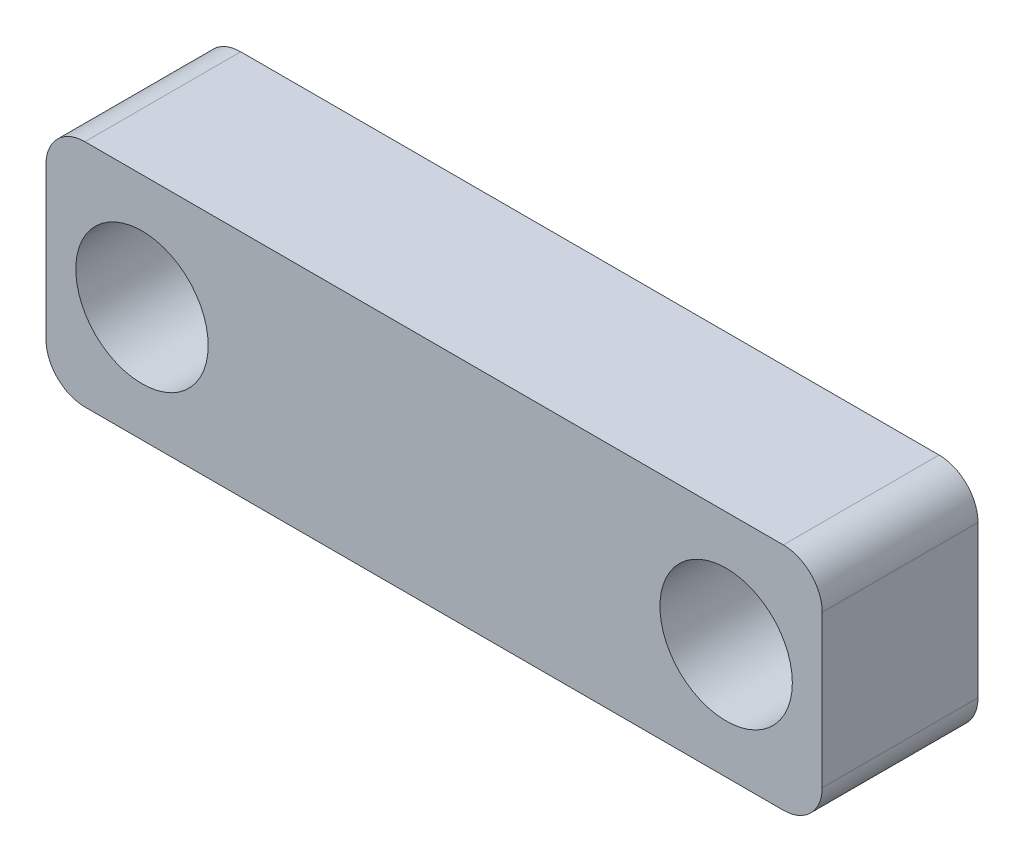
ISO-10303-21;
HEADER;
FILE_DESCRIPTION(('STEP AP214'),'2;1');
FILE_NAME('part.step','',(''),(''),'','','');
FILE_SCHEMA(('AUTOMOTIVE_DESIGN { 1 0 10303 214 1 1 1 1 }'));
ENDSEC;
DATA;
#1=APPLICATION_CONTEXT('core data for automotive mechanical design processes');
#2=APPLICATION_PROTOCOL_DEFINITION('international standard','automotive_design',2000,#1);
#3=PRODUCT_CONTEXT('',#1,'mechanical');
#4=PRODUCT('Part','Part','',(#3));
#5=PRODUCT_RELATED_PRODUCT_CATEGORY('part','',(#4));
#6=PRODUCT_DEFINITION_FORMATION('','',#4);
#7=PRODUCT_DEFINITION_CONTEXT('part definition',#1,'design');
#8=PRODUCT_DEFINITION('design','',#6,#7);
#9=PRODUCT_DEFINITION_SHAPE('','',#8);
#10=(LENGTH_UNIT() NAMED_UNIT(*) SI_UNIT(.MILLI.,.METRE.));
#11=(NAMED_UNIT(*) PLANE_ANGLE_UNIT() SI_UNIT($,.RADIAN.));
#12=(NAMED_UNIT(*) SI_UNIT($,.STERADIAN.) SOLID_ANGLE_UNIT());
#13=UNCERTAINTY_MEASURE_WITH_UNIT(LENGTH_MEASURE(1.E-05),#10,'distance_accuracy_value','');
#14=(GEOMETRIC_REPRESENTATION_CONTEXT(3) GLOBAL_UNCERTAINTY_ASSIGNED_CONTEXT((#13)) GLOBAL_UNIT_ASSIGNED_CONTEXT((#10,
#11,#12)) REPRESENTATION_CONTEXT('',''));
#15=CARTESIAN_POINT('',(0.,0.,0.));
#16=DIRECTION('',(0.,0.,1.));
#17=DIRECTION('',(1.,0.,0.));
#18=AXIS2_PLACEMENT_3D('',#15,#16,#17);
#19=CARTESIAN_POINT('',(-31.2221207225802,40.9398112558445,137.365661293432));
#20=DIRECTION('',(1.,0.,0.));
#21=DIRECTION('',(0.,0.,-1.));
#22=AXIS2_PLACEMENT_3D('',#19,#20,#21);
#23=PLANE('',#22);
#24=DIRECTION('',(0.,-1.,0.));
#25=VECTOR('',#24,1.);
#26=CARTESIAN_POINT('',(-31.2221207225802,40.9398112558445,133.365661293432));
#27=LINE('',#26,#25);
#28=CARTESIAN_POINT('',(-31.2221207225802,39.9398112558445,133.365661293432));
#29=VERTEX_POINT('',#28);
#30=CARTESIAN_POINT('',(-31.2221207225802,36.0398112558445,133.365661293432));
#31=VERTEX_POINT('',#30);
#32=EDGE_CURVE('E133',#29,#31,#27,.T.);
#33=ORIENTED_EDGE('',*,*,#32,.T.);
#34=DIRECTION('',(0.,0.,-1.));
#35=VECTOR('',#34,1.);
#36=CARTESIAN_POINT('',(-31.2221207225802,36.0398112558445,137.365661293432));
#37=LINE('',#36,#35);
#38=CARTESIAN_POINT('',(-31.2221207225802,36.0398112558445,137.365661293432));
#39=VERTEX_POINT('',#38);
#40=EDGE_CURVE('E11',#31,#39,#37,.F.);
#41=ORIENTED_EDGE('',*,*,#40,.T.);
#42=DIRECTION('',(0.,-1.,0.));
#43=VECTOR('',#42,1.);
#44=CARTESIAN_POINT('',(-31.2221207225802,40.9398112558445,137.365661293432));
#45=LINE('',#44,#43);
#46=CARTESIAN_POINT('',(-31.2221207225802,39.9398112558445,137.365661293432));
#47=VERTEX_POINT('',#46);
#48=EDGE_CURVE('E131',#47,#39,#45,.T.);
#49=ORIENTED_EDGE('',*,*,#48,.F.);
#50=DIRECTION('',(0.,0.,-1.));
#51=VECTOR('',#50,1.);
#52=CARTESIAN_POINT('',(-31.2221207225802,39.9398112558445,137.365661293432));
#53=LINE('',#52,#51);
#54=EDGE_CURVE('E44',#47,#29,#53,.T.);
#55=ORIENTED_EDGE('',*,*,#54,.T.);
#56=EDGE_LOOP('',(#33,#41,#49,#55));
#57=FACE_BOUND('',#56,.T.);
#58=ADVANCED_FACE('F35',(#57),#23,.F.);
#59=CARTESIAN_POINT('',(-31.2221207225802,35.0398112558445,137.365661293432));
#60=DIRECTION('',(0.,1.,0.));
#61=DIRECTION('',(0.,0.,1.));
#62=AXIS2_PLACEMENT_3D('',#59,#60,#61);
#63=PLANE('',#62);
#64=DIRECTION('',(1.,0.,0.));
#65=VECTOR('',#64,1.);
#66=CARTESIAN_POINT('',(-31.2221207225802,35.0398112558445,133.365661293432));
#67=LINE('',#66,#65);
#68=CARTESIAN_POINT('',(-30.2221207225802,35.0398112558445,133.365661293432));
#69=VERTEX_POINT('',#68);
#70=CARTESIAN_POINT('',(-12.2894893378649,35.0398112558445,133.365661293432));
#71=VERTEX_POINT('',#70);
#72=EDGE_CURVE('E129',#69,#71,#67,.T.);
#73=ORIENTED_EDGE('',*,*,#72,.T.);
#74=DIRECTION('',(0.,0.,-1.));
#75=VECTOR('',#74,1.);
#76=CARTESIAN_POINT('',(-12.2894893378649,35.0398112558445,137.365661293432));
#77=LINE('',#76,#75);
#78=CARTESIAN_POINT('',(-12.2894893378649,35.0398112558445,137.365661293432));
#79=VERTEX_POINT('',#78);
#80=EDGE_CURVE('E108',#71,#79,#77,.F.);
#81=ORIENTED_EDGE('',*,*,#80,.T.);
#82=DIRECTION('',(1.,0.,0.));
#83=VECTOR('',#82,1.);
#84=CARTESIAN_POINT('',(-31.2221207225802,35.0398112558445,137.365661293432));
#85=LINE('',#84,#83);
#86=CARTESIAN_POINT('',(-30.2221207225802,35.0398112558445,137.365661293432));
#87=VERTEX_POINT('',#86);
#88=EDGE_CURVE('E174',#87,#79,#85,.T.);
#89=ORIENTED_EDGE('',*,*,#88,.F.);
#90=DIRECTION('',(0.,0.,-1.));
#91=VECTOR('',#90,1.);
#92=CARTESIAN_POINT('',(-30.2221207225802,35.0398112558445,137.365661293432));
#93=LINE('',#92,#91);
#94=EDGE_CURVE('E113',#87,#69,#93,.T.);
#95=ORIENTED_EDGE('',*,*,#94,.T.);
#96=EDGE_LOOP('',(#73,#81,#89,#95));
#97=FACE_BOUND('',#96,.T.);
#98=ADVANCED_FACE('F193',(#97),#63,.F.);
#99=CARTESIAN_POINT('',(-11.2894893378649,40.9398112558445,137.365661293432));
#100=DIRECTION('',(-1.,0.,0.));
#101=DIRECTION('',(0.,-1.,0.));
#102=AXIS2_PLACEMENT_3D('',#99,#100,#101);
#103=PLANE('',#102);
#104=DIRECTION('',(0.,1.,0.));
#105=VECTOR('',#104,1.);
#106=CARTESIAN_POINT('',(-11.2894893378649,40.9398112558445,137.365661293432));
#107=LINE('',#106,#105);
#108=CARTESIAN_POINT('',(-11.2894893378649,36.0398112558445,137.365661293432));
#109=VERTEX_POINT('',#108);
#110=CARTESIAN_POINT('',(-11.2894893378649,39.9398112558445,137.365661293432));
#111=VERTEX_POINT('',#110);
#112=EDGE_CURVE('E122',#109,#111,#107,.T.);
#113=ORIENTED_EDGE('',*,*,#112,.F.);
#114=DIRECTION('',(0.,0.,-1.));
#115=VECTOR('',#114,1.);
#116=CARTESIAN_POINT('',(-11.2894893378649,36.0398112558445,137.365661293432));
#117=LINE('',#116,#115);
#118=CARTESIAN_POINT('',(-11.2894893378649,36.0398112558445,133.365661293432));
#119=VERTEX_POINT('',#118);
#120=EDGE_CURVE('E107',#109,#119,#117,.T.);
#121=ORIENTED_EDGE('',*,*,#120,.T.);
#122=DIRECTION('',(0.,1.,0.));
#123=VECTOR('',#122,1.);
#124=CARTESIAN_POINT('',(-11.2894893378649,40.9398112558445,133.365661293432));
#125=LINE('',#124,#123);
#126=CARTESIAN_POINT('',(-11.2894893378649,39.9398112558445,133.365661293432));
#127=VERTEX_POINT('',#126);
#128=EDGE_CURVE('E120',#119,#127,#125,.T.);
#129=ORIENTED_EDGE('',*,*,#128,.T.);
#130=DIRECTION('',(0.,0.,-1.));
#131=VECTOR('',#130,1.);
#132=CARTESIAN_POINT('',(-11.2894893378649,39.9398112558445,137.365661293432));
#133=LINE('',#132,#131);
#134=EDGE_CURVE('E124',#127,#111,#133,.F.);
#135=ORIENTED_EDGE('',*,*,#134,.T.);
#136=EDGE_LOOP('',(#113,#121,#129,#135));
#137=FACE_BOUND('',#136,.T.);
#138=ADVANCED_FACE('F119',(#137),#103,.F.);
#139=CARTESIAN_POINT('',(-31.2221207225802,40.9398112558445,137.365661293432));
#140=DIRECTION('',(0.,-1.,0.));
#141=DIRECTION('',(0.,0.,-1.));
#142=AXIS2_PLACEMENT_3D('',#139,#140,#141);
#143=PLANE('',#142);
#144=DIRECTION('',(-1.,0.,0.));
#145=VECTOR('',#144,1.);
#146=CARTESIAN_POINT('',(-31.2221207225802,40.9398112558445,137.365661293432));
#147=LINE('',#146,#145);
#148=CARTESIAN_POINT('',(-12.2894893378649,40.9398112558445,137.365661293432));
#149=VERTEX_POINT('',#148);
#150=CARTESIAN_POINT('',(-30.2221207225802,40.9398112558445,137.365661293432));
#151=VERTEX_POINT('',#150);
#152=EDGE_CURVE('E137',#149,#151,#147,.T.);
#153=ORIENTED_EDGE('',*,*,#152,.F.);
#154=DIRECTION('',(0.,0.,-1.));
#155=VECTOR('',#154,1.);
#156=CARTESIAN_POINT('',(-12.2894893378649,40.9398112558445,137.365661293432));
#157=LINE('',#156,#155);
#158=CARTESIAN_POINT('',(-12.2894893378649,40.9398112558445,133.365661293432));
#159=VERTEX_POINT('',#158);
#160=EDGE_CURVE('E154',#149,#159,#157,.T.);
#161=ORIENTED_EDGE('',*,*,#160,.T.);
#162=DIRECTION('',(-1.,0.,0.));
#163=VECTOR('',#162,1.);
#164=CARTESIAN_POINT('',(-31.2221207225802,40.9398112558445,133.365661293432));
#165=LINE('',#164,#163);
#166=CARTESIAN_POINT('',(-30.2221207225802,40.9398112558445,133.365661293432));
#167=VERTEX_POINT('',#166);
#168=EDGE_CURVE('E128',#159,#167,#165,.T.);
#169=ORIENTED_EDGE('',*,*,#168,.T.);
#170=DIRECTION('',(0.,0.,-1.));
#171=VECTOR('',#170,1.);
#172=CARTESIAN_POINT('',(-30.2221207225802,40.9398112558445,137.365661293432));
#173=LINE('',#172,#171);
#174=EDGE_CURVE('E52',#167,#151,#173,.F.);
#175=ORIENTED_EDGE('',*,*,#174,.T.);
#176=EDGE_LOOP('',(#153,#161,#169,#175));
#177=FACE_BOUND('',#176,.T.);
#178=ADVANCED_FACE('F196',(#177),#143,.F.);
#179=CARTESIAN_POINT('',(0.,0.,137.365661293432));
#180=DIRECTION('',(0.,0.,1.));
#181=DIRECTION('',(1.,0.,0.));
#182=AXIS2_PLACEMENT_3D('',#179,#180,#181);
#183=PLANE('',#182);
#184=CARTESIAN_POINT('',(-28.7571207225802,37.9898112558445,137.365661293432));
#185=DIRECTION('',(0.,0.,1.));
#186=DIRECTION('',(1.,0.,0.));
#187=AXIS2_PLACEMENT_3D('',#184,#185,#186);
#188=CIRCLE('',#187,1.7);
#189=CARTESIAN_POINT('',(-27.0571207225802,37.9898112558445,137.365661293432));
#190=VERTEX_POINT('',#189);
#191=EDGE_CURVE('E169',#190,#190,#188,.T.);
#192=ORIENTED_EDGE('',*,*,#191,.F.);
#193=EDGE_LOOP('',(#192));
#194=FACE_BOUND('',#193,.T.);
#195=CARTESIAN_POINT('',(-13.7571207225802,37.9898112558445,137.365661293432));
#196=DIRECTION('',(0.,0.,1.));
#197=DIRECTION('',(1.,0.,0.));
#198=AXIS2_PLACEMENT_3D('',#195,#196,#197);
#199=CIRCLE('',#198,1.7);
#200=CARTESIAN_POINT('',(-12.0571207225802,37.9898112558445,137.365661293432));
#201=VERTEX_POINT('',#200);
#202=EDGE_CURVE('E160',#201,#201,#199,.T.);
#203=ORIENTED_EDGE('',*,*,#202,.F.);
#204=EDGE_LOOP('',(#203));
#205=FACE_BOUND('',#204,.T.);
#206=ORIENTED_EDGE('',*,*,#88,.T.);
#207=CARTESIAN_POINT('',(-12.2894893378649,36.0398112558445,137.365661293432));
#208=DIRECTION('',(0.,0.,1.));
#209=DIRECTION('',(1.,0.,0.));
#210=AXIS2_PLACEMENT_3D('',#207,#208,#209);
#211=CIRCLE('',#210,1.);
#212=EDGE_CURVE('E151',#79,#109,#211,.T.);
#213=ORIENTED_EDGE('',*,*,#212,.T.);
#214=ORIENTED_EDGE('',*,*,#112,.T.);
#215=CARTESIAN_POINT('',(-12.2894893378649,39.9398112558445,137.365661293432));
#216=DIRECTION('',(0.,0.,1.));
#217=DIRECTION('',(1.,0.,0.));
#218=AXIS2_PLACEMENT_3D('',#215,#216,#217);
#219=CIRCLE('',#218,1.);
#220=EDGE_CURVE('E59',#111,#149,#219,.T.);
#221=ORIENTED_EDGE('',*,*,#220,.T.);
#222=ORIENTED_EDGE('',*,*,#152,.T.);
#223=CARTESIAN_POINT('',(-30.2221207225802,39.9398112558445,137.365661293432));
#224=DIRECTION('',(0.,0.,1.));
#225=DIRECTION('',(1.,0.,0.));
#226=AXIS2_PLACEMENT_3D('',#223,#224,#225);
#227=CIRCLE('',#226,1.);
#228=EDGE_CURVE('E146',#151,#47,#227,.T.);
#229=ORIENTED_EDGE('',*,*,#228,.T.);
#230=ORIENTED_EDGE('',*,*,#48,.T.);
#231=CARTESIAN_POINT('',(-30.2221207225802,36.0398112558445,137.365661293432));
#232=DIRECTION('',(0.,0.,1.));
#233=DIRECTION('',(1.,0.,0.));
#234=AXIS2_PLACEMENT_3D('',#231,#232,#233);
#235=CIRCLE('',#234,1.);
#236=EDGE_CURVE('E148',#39,#87,#235,.T.);
#237=ORIENTED_EDGE('',*,*,#236,.T.);
#238=EDGE_LOOP('',(#206,#213,#214,#221,#222,#229,#230,#237));
#239=FACE_BOUND('',#238,.T.);
#240=ADVANCED_FACE('F179',(#194,#205,#239),#183,.T.);
#241=CARTESIAN_POINT('',(0.,0.,133.365661293432));
#242=DIRECTION('',(0.,0.,1.));
#243=DIRECTION('',(1.,0.,0.));
#244=AXIS2_PLACEMENT_3D('',#241,#242,#243);
#245=PLANE('',#244);
#246=CARTESIAN_POINT('',(-28.7571207225802,37.9898112558445,133.365661293432));
#247=DIRECTION('',(0.,0.,1.));
#248=DIRECTION('',(1.,0.,0.));
#249=AXIS2_PLACEMENT_3D('',#246,#247,#248);
#250=CIRCLE('',#249,1.7);
#251=CARTESIAN_POINT('',(-27.0571207225802,37.9898112558445,133.365661293432));
#252=VERTEX_POINT('',#251);
#253=EDGE_CURVE('E39',#252,#252,#250,.T.);
#254=ORIENTED_EDGE('',*,*,#253,.T.);
#255=EDGE_LOOP('',(#254));
#256=FACE_BOUND('',#255,.T.);
#257=CARTESIAN_POINT('',(-13.7571207225802,37.9898112558445,133.365661293432));
#258=DIRECTION('',(0.,0.,1.));
#259=DIRECTION('',(1.,0.,0.));
#260=AXIS2_PLACEMENT_3D('',#257,#258,#259);
#261=CIRCLE('',#260,1.7);
#262=CARTESIAN_POINT('',(-12.0571207225802,37.9898112558445,133.365661293432));
#263=VERTEX_POINT('',#262);
#264=EDGE_CURVE('E158',#263,#263,#261,.T.);
#265=ORIENTED_EDGE('',*,*,#264,.T.);
#266=EDGE_LOOP('',(#265));
#267=FACE_BOUND('',#266,.T.);
#268=ORIENTED_EDGE('',*,*,#128,.F.);
#269=CARTESIAN_POINT('',(-12.2894893378649,36.0398112558445,133.365661293432));
#270=DIRECTION('',(0.,0.,1.));
#271=DIRECTION('',(1.,0.,0.));
#272=AXIS2_PLACEMENT_3D('',#269,#270,#271);
#273=CIRCLE('',#272,1.);
#274=EDGE_CURVE('E103',#119,#71,#273,.F.);
#275=ORIENTED_EDGE('',*,*,#274,.T.);
#276=ORIENTED_EDGE('',*,*,#72,.F.);
#277=CARTESIAN_POINT('',(-30.2221207225802,36.0398112558445,133.365661293432));
#278=DIRECTION('',(0.,0.,1.));
#279=DIRECTION('',(1.,0.,0.));
#280=AXIS2_PLACEMENT_3D('',#277,#278,#279);
#281=CIRCLE('',#280,1.);
#282=EDGE_CURVE('E140',#69,#31,#281,.F.);
#283=ORIENTED_EDGE('',*,*,#282,.T.);
#284=ORIENTED_EDGE('',*,*,#32,.F.);
#285=CARTESIAN_POINT('',(-30.2221207225802,39.9398112558445,133.365661293432));
#286=DIRECTION('',(0.,0.,1.));
#287=DIRECTION('',(1.,0.,0.));
#288=AXIS2_PLACEMENT_3D('',#285,#286,#287);
#289=CIRCLE('',#288,1.);
#290=EDGE_CURVE('E123',#29,#167,#289,.F.);
#291=ORIENTED_EDGE('',*,*,#290,.T.);
#292=ORIENTED_EDGE('',*,*,#168,.F.);
#293=CARTESIAN_POINT('',(-12.2894893378649,39.9398112558445,133.365661293432));
#294=DIRECTION('',(0.,0.,1.));
#295=DIRECTION('',(1.,0.,0.));
#296=AXIS2_PLACEMENT_3D('',#293,#294,#295);
#297=CIRCLE('',#296,1.);
#298=EDGE_CURVE('E114',#159,#127,#297,.F.);
#299=ORIENTED_EDGE('',*,*,#298,.T.);
#300=EDGE_LOOP('',(#268,#275,#276,#283,#284,#291,#292,#299));
#301=FACE_BOUND('',#300,.T.);
#302=ADVANCED_FACE('F126',(#256,#267,#301),#245,.F.);
#303=CARTESIAN_POINT('',(-12.2894893378649,36.0398112558445,137.365661293432));
#304=DIRECTION('',(0.,0.,-1.));
#305=DIRECTION('',(-1.,0.,0.));
#306=AXIS2_PLACEMENT_3D('',#303,#304,#305);
#307=CYLINDRICAL_SURFACE('',#306,1.);
#308=ORIENTED_EDGE('',*,*,#212,.F.);
#309=ORIENTED_EDGE('',*,*,#80,.F.);
#310=ORIENTED_EDGE('',*,*,#274,.F.);
#311=ORIENTED_EDGE('',*,*,#120,.F.);
#312=EDGE_LOOP('',(#308,#309,#310,#311));
#313=FACE_BOUND('',#312,.T.);
#314=ADVANCED_FACE('F106',(#313),#307,.T.);
#315=CARTESIAN_POINT('',(-12.2894893378649,39.9398112558445,137.365661293432));
#316=DIRECTION('',(0.,0.,-1.));
#317=DIRECTION('',(-1.,0.,0.));
#318=AXIS2_PLACEMENT_3D('',#315,#316,#317);
#319=CYLINDRICAL_SURFACE('',#318,1.);
#320=ORIENTED_EDGE('',*,*,#220,.F.);
#321=ORIENTED_EDGE('',*,*,#134,.F.);
#322=ORIENTED_EDGE('',*,*,#298,.F.);
#323=ORIENTED_EDGE('',*,*,#160,.F.);
#324=EDGE_LOOP('',(#320,#321,#322,#323));
#325=FACE_BOUND('',#324,.T.);
#326=ADVANCED_FACE('F195',(#325),#319,.T.);
#327=CARTESIAN_POINT('',(-30.2221207225802,36.0398112558445,137.365661293432));
#328=DIRECTION('',(0.,0.,-1.));
#329=DIRECTION('',(-1.,0.,0.));
#330=AXIS2_PLACEMENT_3D('',#327,#328,#329);
#331=CYLINDRICAL_SURFACE('',#330,1.);
#332=ORIENTED_EDGE('',*,*,#236,.F.);
#333=ORIENTED_EDGE('',*,*,#40,.F.);
#334=ORIENTED_EDGE('',*,*,#282,.F.);
#335=ORIENTED_EDGE('',*,*,#94,.F.);
#336=EDGE_LOOP('',(#332,#333,#334,#335));
#337=FACE_BOUND('',#336,.T.);
#338=ADVANCED_FACE('F190',(#337),#331,.T.);
#339=CARTESIAN_POINT('',(-30.2221207225802,39.9398112558445,137.365661293432));
#340=DIRECTION('',(0.,0.,-1.));
#341=DIRECTION('',(-1.,0.,0.));
#342=AXIS2_PLACEMENT_3D('',#339,#340,#341);
#343=CYLINDRICAL_SURFACE('',#342,1.);
#344=ORIENTED_EDGE('',*,*,#228,.F.);
#345=ORIENTED_EDGE('',*,*,#174,.F.);
#346=ORIENTED_EDGE('',*,*,#290,.F.);
#347=ORIENTED_EDGE('',*,*,#54,.F.);
#348=EDGE_LOOP('',(#344,#345,#346,#347));
#349=FACE_BOUND('',#348,.T.);
#350=ADVANCED_FACE('F37',(#349),#343,.T.);
#351=CARTESIAN_POINT('',(-13.7571207225802,37.9898112558445,137.365661293432));
#352=DIRECTION('',(0.,0.,1.));
#353=DIRECTION('',(1.,0.,0.));
#354=AXIS2_PLACEMENT_3D('',#351,#352,#353);
#355=CYLINDRICAL_SURFACE('',#354,1.7);
#356=ORIENTED_EDGE('',*,*,#202,.T.);
#357=EDGE_LOOP('',(#356));
#358=FACE_BOUND('',#357,.T.);
#359=ORIENTED_EDGE('',*,*,#264,.F.);
#360=EDGE_LOOP('',(#359));
#361=FACE_BOUND('',#360,.T.);
#362=ADVANCED_FACE('F221',(#358,#361),#355,.F.);
#363=CARTESIAN_POINT('',(-28.7571207225802,37.9898112558445,137.365661293432));
#364=DIRECTION('',(0.,0.,1.));
#365=DIRECTION('',(1.,0.,0.));
#366=AXIS2_PLACEMENT_3D('',#363,#364,#365);
#367=CYLINDRICAL_SURFACE('',#366,1.7);
#368=ORIENTED_EDGE('',*,*,#191,.T.);
#369=EDGE_LOOP('',(#368));
#370=FACE_BOUND('',#369,.T.);
#371=ORIENTED_EDGE('',*,*,#253,.F.);
#372=EDGE_LOOP('',(#371));
#373=FACE_BOUND('',#372,.T.);
#374=ADVANCED_FACE('F225',(#370,#373),#367,.F.);
#375=CLOSED_SHELL('',(#58,#98,#138,#178,#240,#302,#314,#326,#338,#350,#362,#374));
#376=MANIFOLD_SOLID_BREP('B2',#375);
#377=ADVANCED_BREP_SHAPE_REPRESENTATION('',(#18,#376),#14);
#378=SHAPE_DEFINITION_REPRESENTATION(#9,#377);
ENDSEC;
END-ISO-10303-21;
